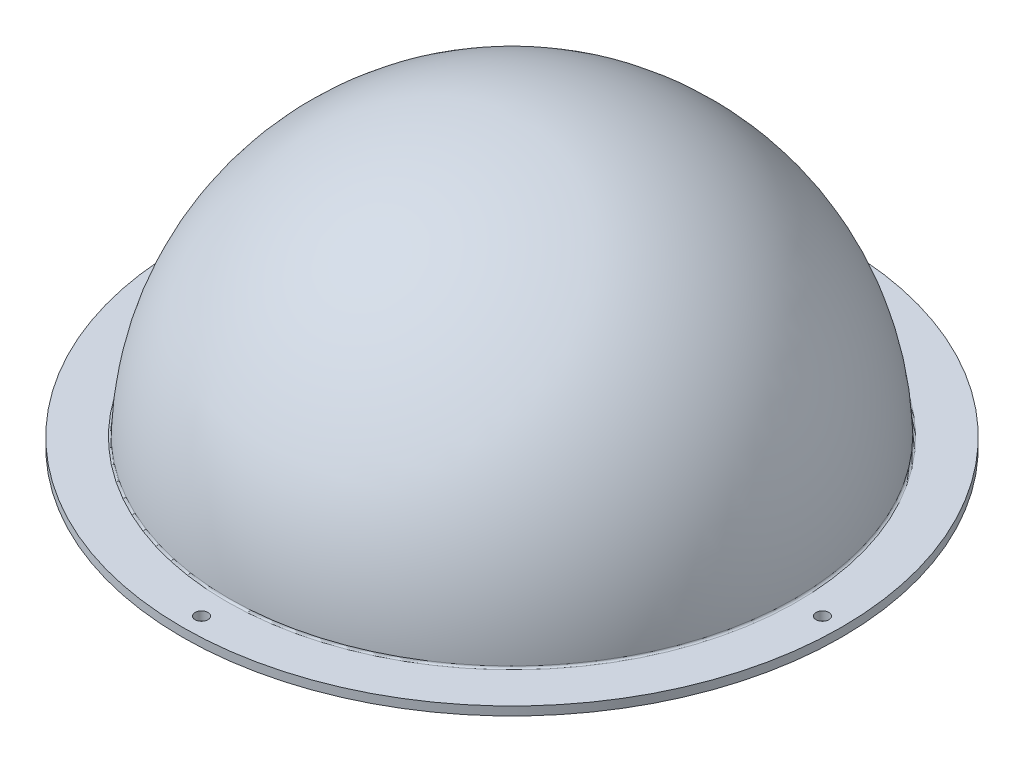
ISO-10303-21;
HEADER;
FILE_DESCRIPTION(('STEP AP214'),'2;1');
FILE_NAME('part.step','',(''),(''),'','','');
FILE_SCHEMA(('AUTOMOTIVE_DESIGN { 1 0 10303 214 1 1 1 1 }'));
ENDSEC;
DATA;
#1=APPLICATION_CONTEXT('core data for automotive mechanical design processes');
#2=APPLICATION_PROTOCOL_DEFINITION('international standard','automotive_design',2000,#1);
#3=PRODUCT_CONTEXT('',#1,'mechanical');
#4=PRODUCT('Part','Part','',(#3));
#5=PRODUCT_RELATED_PRODUCT_CATEGORY('part','',(#4));
#6=PRODUCT_DEFINITION_FORMATION('','',#4);
#7=PRODUCT_DEFINITION_CONTEXT('part definition',#1,'design');
#8=PRODUCT_DEFINITION('design','',#6,#7);
#9=PRODUCT_DEFINITION_SHAPE('','',#8);
#10=(LENGTH_UNIT() NAMED_UNIT(*) SI_UNIT(.MILLI.,.METRE.));
#11=(NAMED_UNIT(*) PLANE_ANGLE_UNIT() SI_UNIT($,.RADIAN.));
#12=(NAMED_UNIT(*) SI_UNIT($,.STERADIAN.) SOLID_ANGLE_UNIT());
#13=UNCERTAINTY_MEASURE_WITH_UNIT(LENGTH_MEASURE(1.E-05),#10,'distance_accuracy_value','');
#14=(GEOMETRIC_REPRESENTATION_CONTEXT(3) GLOBAL_UNCERTAINTY_ASSIGNED_CONTEXT((#13)) GLOBAL_UNIT_ASSIGNED_CONTEXT((#10,
#11,#12)) REPRESENTATION_CONTEXT('',''));
#15=CARTESIAN_POINT('',(0.,0.,0.));
#16=DIRECTION('',(0.,0.,1.));
#17=DIRECTION('',(1.,0.,0.));
#18=AXIS2_PLACEMENT_3D('',#15,#16,#17);
#19=CARTESIAN_POINT('',(0.,0.,0.));
#20=DIRECTION('',(0.,-1.,0.));
#21=DIRECTION('',(0.,0.,-1.));
#22=AXIS2_PLACEMENT_3D('',#19,#20,#21);
#23=PLANE('',#22);
#24=CARTESIAN_POINT('',(0.,0.,0.));
#25=DIRECTION('',(0.,-1.,0.));
#26=DIRECTION('',(0.,0.,-1.));
#27=AXIS2_PLACEMENT_3D('',#24,#25,#26);
#28=CIRCLE('',#27,72.8894502303317);
#29=CARTESIAN_POINT('',(0.,0.,-72.8894502303317));
#30=VERTEX_POINT('',#29);
#31=EDGE_CURVE('E50',#30,#30,#28,.F.);
#32=ORIENTED_EDGE('',*,*,#31,.T.);
#33=EDGE_LOOP('',(#32));
#34=FACE_BOUND('',#33,.T.);
#35=CARTESIAN_POINT('',(0.,0.,-79.97825));
#36=DIRECTION('',(0.,-1.,0.));
#37=DIRECTION('',(0.,0.,-1.));
#38=AXIS2_PLACEMENT_3D('',#35,#36,#37);
#39=CIRCLE('',#38,1.651);
#40=CARTESIAN_POINT('',(0.,0.,-81.62925));
#41=VERTEX_POINT('',#40);
#42=EDGE_CURVE('E65',#41,#41,#39,.F.);
#43=ORIENTED_EDGE('',*,*,#42,.T.);
#44=EDGE_LOOP('',(#43));
#45=FACE_BOUND('',#44,.T.);
#46=CARTESIAN_POINT('',(79.97825,0.,2.79242567388331E-13));
#47=DIRECTION('',(0.,-1.,0.));
#48=DIRECTION('',(0.,0.,-1.));
#49=AXIS2_PLACEMENT_3D('',#46,#47,#48);
#50=CIRCLE('',#49,1.651);
#51=CARTESIAN_POINT('',(79.97825,0.,-1.65099999999972));
#52=VERTEX_POINT('',#51);
#53=EDGE_CURVE('E79',#52,#52,#50,.F.);
#54=ORIENTED_EDGE('',*,*,#53,.T.);
#55=EDGE_LOOP('',(#54));
#56=FACE_BOUND('',#55,.T.);
#57=CARTESIAN_POINT('',(2.24373504989304E-12,0.,79.97825));
#58=DIRECTION('',(0.,-1.,0.));
#59=DIRECTION('',(0.,0.,-1.));
#60=AXIS2_PLACEMENT_3D('',#57,#58,#59);
#61=CIRCLE('',#60,1.65100000000268);
#62=CARTESIAN_POINT('',(2.24373504989304E-12,0.,78.3272499999973));
#63=VERTEX_POINT('',#62);
#64=EDGE_CURVE('E73',#63,#63,#61,.F.);
#65=ORIENTED_EDGE('',*,*,#64,.T.);
#66=EDGE_LOOP('',(#65));
#67=FACE_BOUND('',#66,.T.);
#68=CARTESIAN_POINT('',(-79.9782499999989,0.,1.13166203573291E-12));
#69=DIRECTION('',(0.,-1.,0.));
#70=DIRECTION('',(0.,0.,-1.));
#71=AXIS2_PLACEMENT_3D('',#68,#69,#70);
#72=CIRCLE('',#71,1.6510000000022);
#73=CARTESIAN_POINT('',(-79.9782499999989,0.,-1.65100000000107));
#74=VERTEX_POINT('',#73);
#75=EDGE_CURVE('E66',#74,#74,#72,.F.);
#76=ORIENTED_EDGE('',*,*,#75,.T.);
#77=EDGE_LOOP('',(#76));
#78=FACE_BOUND('',#77,.T.);
#79=CARTESIAN_POINT('',(0.,0.,0.));
#80=DIRECTION('',(0.,-1.,0.));
#81=DIRECTION('',(0.,0.,-1.));
#82=AXIS2_PLACEMENT_3D('',#79,#80,#81);
#83=CIRCLE('',#82,84.93125);
#84=CARTESIAN_POINT('',(0.,0.,-84.93125));
#85=VERTEX_POINT('',#84);
#86=EDGE_CURVE('E62',#85,#85,#83,.T.);
#87=ORIENTED_EDGE('',*,*,#86,.T.);
#88=EDGE_LOOP('',(#87));
#89=FACE_BOUND('',#88,.T.);
#90=ADVANCED_FACE('F39',(#34,#45,#56,#67,#78,#89),#23,.T.);
#91=CARTESIAN_POINT('',(0.,-0.0352884104772161,0.));
#92=DIRECTION('',(0.,-1.,0.));
#93=DIRECTION('',(1.,0.,0.));
#94=AXIS2_PLACEMENT_3D('',#91,#92,#93);
#95=SPHERICAL_SURFACE('',#94,73.0602884104772);
#96=CARTESIAN_POINT('',(0.,2.72401412327214,0.));
#97=DIRECTION('',(0.,-1.,0.));
#98=DIRECTION('',(0.,0.,-1.));
#99=AXIS2_PLACEMENT_3D('',#96,#97,#98);
#100=CIRCLE('',#99,73.0081638732913);
#101=CARTESIAN_POINT('',(0.,2.72401412327214,-73.0081638732913));
#102=VERTEX_POINT('',#101);
#103=EDGE_CURVE('E10',#102,#102,#100,.F.);
#104=ORIENTED_EDGE('',*,*,#103,.T.);
#105=EDGE_LOOP('',(#104));
#106=FACE_BOUND('',#105,.T.);
#107=ADVANCED_FACE('F97',(#106),#95,.T.);
#108=CARTESIAN_POINT('',(84.93125,2.23519999999999,0.));
#109=DIRECTION('',(0.,1.,0.));
#110=DIRECTION('',(0.,0.,1.));
#111=AXIS2_PLACEMENT_3D('',#108,#109,#110);
#112=PLANE('',#111);
#113=CARTESIAN_POINT('',(0.,2.23519999999999,0.));
#114=DIRECTION('',(0.,1.,0.));
#115=DIRECTION('',(0.,0.,1.));
#116=AXIS2_PLACEMENT_3D('',#113,#114,#115);
#117=CIRCLE('',#116,73.5158014429551);
#118=CARTESIAN_POINT('',(0.,2.23519999999999,73.5158014429551));
#119=VERTEX_POINT('',#118);
#120=EDGE_CURVE('E46',#119,#119,#117,.F.);
#121=ORIENTED_EDGE('',*,*,#120,.T.);
#122=EDGE_LOOP('',(#121));
#123=FACE_BOUND('',#122,.T.);
#124=CARTESIAN_POINT('',(0.,2.23519999999999,-79.97825));
#125=DIRECTION('',(0.,1.,0.));
#126=DIRECTION('',(0.,0.,1.));
#127=AXIS2_PLACEMENT_3D('',#124,#125,#126);
#128=CIRCLE('',#127,1.651);
#129=CARTESIAN_POINT('',(0.,2.23519999999999,-78.32725));
#130=VERTEX_POINT('',#129);
#131=EDGE_CURVE('E82',#130,#130,#128,.T.);
#132=ORIENTED_EDGE('',*,*,#131,.F.);
#133=EDGE_LOOP('',(#132));
#134=FACE_BOUND('',#133,.T.);
#135=CARTESIAN_POINT('',(79.97825,2.23519999999999,2.79242567388331E-13));
#136=DIRECTION('',(0.,1.,0.));
#137=DIRECTION('',(0.,0.,1.));
#138=AXIS2_PLACEMENT_3D('',#135,#136,#137);
#139=CIRCLE('',#138,1.651);
#140=CARTESIAN_POINT('',(79.97825,2.23519999999999,1.65100000000028));
#141=VERTEX_POINT('',#140);
#142=EDGE_CURVE('E76',#141,#141,#139,.T.);
#143=ORIENTED_EDGE('',*,*,#142,.F.);
#144=EDGE_LOOP('',(#143));
#145=FACE_BOUND('',#144,.T.);
#146=CARTESIAN_POINT('',(2.24373504989304E-12,2.23519999999999,79.97825));
#147=DIRECTION('',(0.,1.,0.));
#148=DIRECTION('',(0.,0.,1.));
#149=AXIS2_PLACEMENT_3D('',#146,#147,#148);
#150=CIRCLE('',#149,1.65100000000268);
#151=CARTESIAN_POINT('',(2.24373504989304E-12,2.23519999999999,81.6292500000027));
#152=VERTEX_POINT('',#151);
#153=EDGE_CURVE('E69',#152,#152,#150,.T.);
#154=ORIENTED_EDGE('',*,*,#153,.F.);
#155=EDGE_LOOP('',(#154));
#156=FACE_BOUND('',#155,.T.);
#157=CARTESIAN_POINT('',(-79.9782499999989,2.23519999999999,1.13166203573291E-12));
#158=DIRECTION('',(0.,1.,0.));
#159=DIRECTION('',(0.,0.,1.));
#160=AXIS2_PLACEMENT_3D('',#157,#158,#159);
#161=CIRCLE('',#160,1.6510000000022);
#162=CARTESIAN_POINT('',(-79.9782499999989,2.23519999999999,1.65100000000334));
#163=VERTEX_POINT('',#162);
#164=EDGE_CURVE('E70',#163,#163,#161,.T.);
#165=ORIENTED_EDGE('',*,*,#164,.F.);
#166=EDGE_LOOP('',(#165));
#167=FACE_BOUND('',#166,.T.);
#168=CARTESIAN_POINT('',(0.,2.23519999999999,0.));
#169=DIRECTION('',(0.,-1.,0.));
#170=DIRECTION('',(0.,0.,-1.));
#171=AXIS2_PLACEMENT_3D('',#168,#169,#170);
#172=CIRCLE('',#171,84.93125);
#173=CARTESIAN_POINT('',(0.,2.23519999999999,-84.93125));
#174=VERTEX_POINT('',#173);
#175=EDGE_CURVE('E59',#174,#174,#172,.T.);
#176=ORIENTED_EDGE('',*,*,#175,.F.);
#177=EDGE_LOOP('',(#176));
#178=FACE_BOUND('',#177,.T.);
#179=ADVANCED_FACE('F93',(#123,#134,#145,#156,#167,#178),#112,.T.);
#180=CARTESIAN_POINT('',(0.,0.,0.));
#181=DIRECTION('',(0.,-1.,0.));
#182=DIRECTION('',(0.,0.,-1.));
#183=AXIS2_PLACEMENT_3D('',#180,#181,#182);
#184=CYLINDRICAL_SURFACE('',#183,84.93125);
#185=ORIENTED_EDGE('',*,*,#175,.T.);
#186=EDGE_LOOP('',(#185));
#187=FACE_BOUND('',#186,.T.);
#188=ORIENTED_EDGE('',*,*,#86,.F.);
#189=EDGE_LOOP('',(#188));
#190=FACE_BOUND('',#189,.T.);
#191=ADVANCED_FACE('F96',(#187,#190),#184,.T.);
#192=CARTESIAN_POINT('',(0.,-0.0352884104772161,0.));
#193=DIRECTION('',(0.,-1.,0.));
#194=DIRECTION('',(1.,0.,0.));
#195=AXIS2_PLACEMENT_3D('',#192,#193,#194);
#196=SPHERICAL_SURFACE('',#195,70.8250884104772);
#197=CARTESIAN_POINT('',(0.,2.03426808715502,0.));
#198=DIRECTION('',(0.,-1.,0.));
#199=DIRECTION('',(0.,0.,-1.));
#200=AXIS2_PLACEMENT_3D('',#197,#198,#199);
#201=CIRCLE('',#200,70.794845040123);
#202=CARTESIAN_POINT('',(0.,2.03426808715502,-70.794845040123));
#203=VERTEX_POINT('',#202);
#204=EDGE_CURVE('E54',#203,#203,#201,.T.);
#205=ORIENTED_EDGE('',*,*,#204,.T.);
#206=EDGE_LOOP('',(#205));
#207=FACE_BOUND('',#206,.T.);
#208=ADVANCED_FACE('F109',(#207),#196,.F.);
#209=CARTESIAN_POINT('',(-79.9782499999989,-4.66973318296353,1.13166203573291E-12));
#210=DIRECTION('',(0.,1.,0.));
#211=DIRECTION('',(0.,0.,1.));
#212=AXIS2_PLACEMENT_3D('',#209,#210,#211);
#213=CYLINDRICAL_SURFACE('',#212,1.6510000000022);
#214=ORIENTED_EDGE('',*,*,#164,.T.);
#215=EDGE_LOOP('',(#214));
#216=FACE_BOUND('',#215,.T.);
#217=ORIENTED_EDGE('',*,*,#75,.F.);
#218=EDGE_LOOP('',(#217));
#219=FACE_BOUND('',#218,.T.);
#220=ADVANCED_FACE('F136',(#216,#219),#213,.F.);
#221=CARTESIAN_POINT('',(2.24373504989304E-12,-4.66973318296353,79.97825));
#222=DIRECTION('',(0.,1.,0.));
#223=DIRECTION('',(0.,0.,1.));
#224=AXIS2_PLACEMENT_3D('',#221,#222,#223);
#225=CYLINDRICAL_SURFACE('',#224,1.65100000000268);
#226=ORIENTED_EDGE('',*,*,#153,.T.);
#227=EDGE_LOOP('',(#226));
#228=FACE_BOUND('',#227,.T.);
#229=ORIENTED_EDGE('',*,*,#64,.F.);
#230=EDGE_LOOP('',(#229));
#231=FACE_BOUND('',#230,.T.);
#232=ADVANCED_FACE('F141',(#228,#231),#225,.F.);
#233=CARTESIAN_POINT('',(79.97825,-4.66973318296353,2.79242567388331E-13));
#234=DIRECTION('',(0.,1.,0.));
#235=DIRECTION('',(0.,0.,1.));
#236=AXIS2_PLACEMENT_3D('',#233,#234,#235);
#237=CYLINDRICAL_SURFACE('',#236,1.651);
#238=ORIENTED_EDGE('',*,*,#142,.T.);
#239=EDGE_LOOP('',(#238));
#240=FACE_BOUND('',#239,.T.);
#241=ORIENTED_EDGE('',*,*,#53,.F.);
#242=EDGE_LOOP('',(#241));
#243=FACE_BOUND('',#242,.T.);
#244=ADVANCED_FACE('F129',(#240,#243),#237,.F.);
#245=CARTESIAN_POINT('',(0.,-4.66973318296353,-79.97825));
#246=DIRECTION('',(0.,1.,0.));
#247=DIRECTION('',(0.,0.,1.));
#248=AXIS2_PLACEMENT_3D('',#245,#246,#247);
#249=CYLINDRICAL_SURFACE('',#248,1.651);
#250=ORIENTED_EDGE('',*,*,#131,.T.);
#251=EDGE_LOOP('',(#250));
#252=FACE_BOUND('',#251,.T.);
#253=ORIENTED_EDGE('',*,*,#42,.F.);
#254=EDGE_LOOP('',(#253));
#255=FACE_BOUND('',#254,.T.);
#256=ADVANCED_FACE('F90',(#252,#255),#249,.F.);
#257=CARTESIAN_POINT('',(0.,2.0955,0.));
#258=DIRECTION('',(0.,-1.,0.));
#259=DIRECTION('',(0.,0.,-1.));
#260=AXIS2_PLACEMENT_3D('',#257,#258,#259);
#261=TOROIDAL_SURFACE('',#260,72.8894502303317,2.0955);
#262=ORIENTED_EDGE('',*,*,#31,.F.);
#263=EDGE_LOOP('',(#262));
#264=FACE_BOUND('',#263,.T.);
#265=ORIENTED_EDGE('',*,*,#204,.F.);
#266=EDGE_LOOP('',(#265));
#267=FACE_BOUND('',#266,.T.);
#268=ADVANCED_FACE('F121',(#264,#267),#261,.T.);
#269=CARTESIAN_POINT('',(0.,2.74319999999999,0.));
#270=DIRECTION('',(0.,1.,0.));
#271=DIRECTION('',(0.,0.,1.));
#272=AXIS2_PLACEMENT_3D('',#269,#270,#271);
#273=TOROIDAL_SURFACE('',#272,73.5158014429551,0.508);
#274=ORIENTED_EDGE('',*,*,#103,.F.);
#275=EDGE_LOOP('',(#274));
#276=FACE_BOUND('',#275,.T.);
#277=ORIENTED_EDGE('',*,*,#120,.F.);
#278=EDGE_LOOP('',(#277));
#279=FACE_BOUND('',#278,.T.);
#280=ADVANCED_FACE('F41',(#276,#279),#273,.F.);
#281=CLOSED_SHELL('',(#90,#107,#179,#191,#208,#220,#232,#244,#256,#268,#280));
#282=MANIFOLD_SOLID_BREP('B2',#281);
#283=ADVANCED_BREP_SHAPE_REPRESENTATION('',(#18,#282),#14);
#284=SHAPE_DEFINITION_REPRESENTATION(#9,#283);
ENDSEC;
END-ISO-10303-21;
